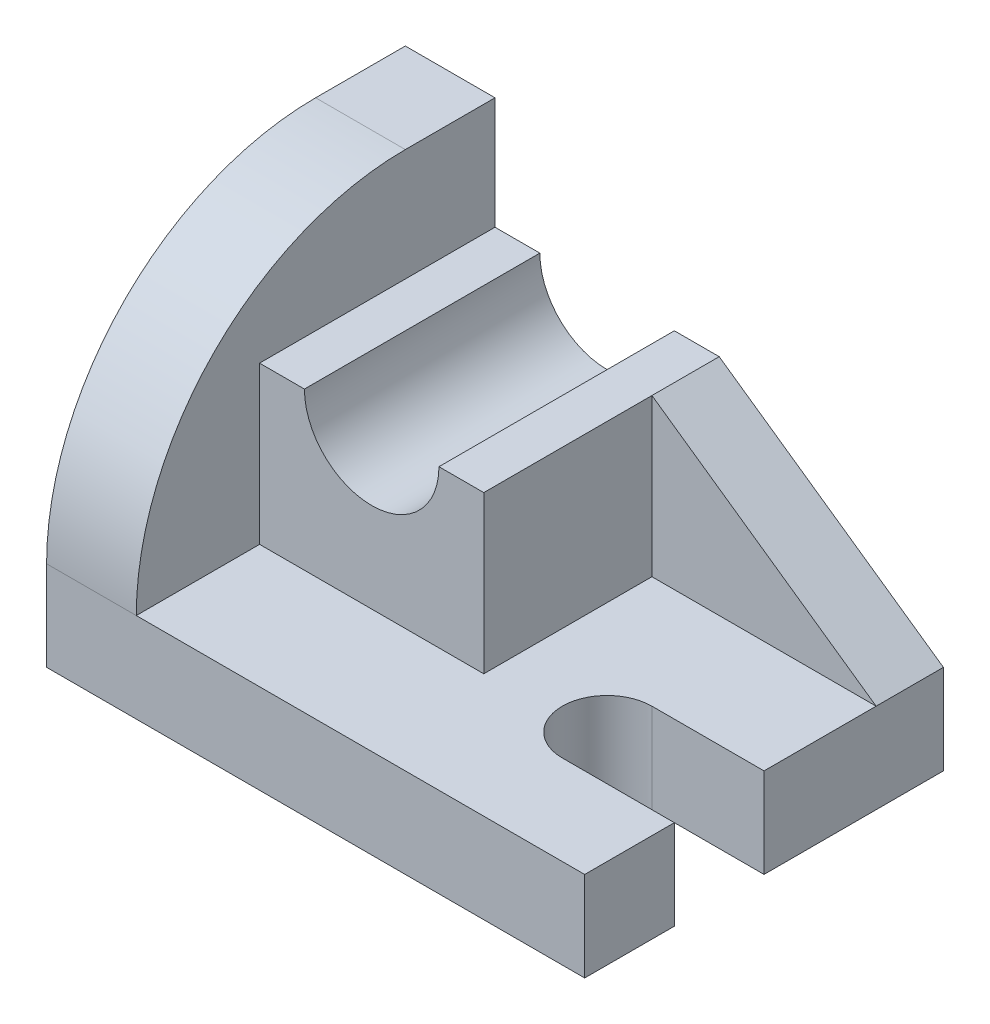
ISO-10303-21;
HEADER;
FILE_DESCRIPTION(('STEP AP214'),'2;1');
FILE_NAME('part.step','',(''),(''),'','','');
FILE_SCHEMA(('AUTOMOTIVE_DESIGN { 1 0 10303 214 1 1 1 1 }'));
ENDSEC;
DATA;
#1=APPLICATION_CONTEXT('core data for automotive mechanical design processes');
#2=APPLICATION_PROTOCOL_DEFINITION('international standard','automotive_design',2000,#1);
#3=PRODUCT_CONTEXT('',#1,'mechanical');
#4=PRODUCT('Part','Part','',(#3));
#5=PRODUCT_RELATED_PRODUCT_CATEGORY('part','',(#4));
#6=PRODUCT_DEFINITION_FORMATION('','',#4);
#7=PRODUCT_DEFINITION_CONTEXT('part definition',#1,'design');
#8=PRODUCT_DEFINITION('design','',#6,#7);
#9=PRODUCT_DEFINITION_SHAPE('','',#8);
#10=(LENGTH_UNIT() NAMED_UNIT(*) SI_UNIT(.MILLI.,.METRE.));
#11=(NAMED_UNIT(*) PLANE_ANGLE_UNIT() SI_UNIT($,.RADIAN.));
#12=(NAMED_UNIT(*) SI_UNIT($,.STERADIAN.) SOLID_ANGLE_UNIT());
#13=UNCERTAINTY_MEASURE_WITH_UNIT(LENGTH_MEASURE(1.E-05),#10,'distance_accuracy_value','');
#14=(GEOMETRIC_REPRESENTATION_CONTEXT(3) GLOBAL_UNCERTAINTY_ASSIGNED_CONTEXT((#13)) GLOBAL_UNIT_ASSIGNED_CONTEXT((#10,
#11,#12)) REPRESENTATION_CONTEXT('',''));
#15=CARTESIAN_POINT('',(0.,0.,0.));
#16=DIRECTION('',(0.,0.,1.));
#17=DIRECTION('',(1.,0.,0.));
#18=AXIS2_PLACEMENT_3D('',#15,#16,#17);
#19=CARTESIAN_POINT('',(56.,44.,-52.));
#20=DIRECTION('',(-1.,0.,0.));
#21=DIRECTION('',(0.,0.,1.));
#22=AXIS2_PLACEMENT_3D('',#19,#20,#21);
#23=PLANE('',#22);
#24=DIRECTION('',(0.,1.,0.));
#25=VECTOR('',#24,1.);
#26=CARTESIAN_POINT('',(56.,44.,-64.));
#27=LINE('',#26,#25);
#28=CARTESIAN_POINT('',(56.,16.,-64.));
#29=VERTEX_POINT('',#28);
#30=CARTESIAN_POINT('',(56.,44.,-64.));
#31=VERTEX_POINT('',#30);
#32=EDGE_CURVE('E101',#29,#31,#27,.T.);
#33=ORIENTED_EDGE('',*,*,#32,.F.);
#34=DIRECTION('',(0.,0.,-1.));
#35=VECTOR('',#34,1.);
#36=CARTESIAN_POINT('',(56.,16.,-52.));
#37=LINE('',#36,#35);
#38=CARTESIAN_POINT('',(56.,16.,-52.));
#39=VERTEX_POINT('',#38);
#40=EDGE_CURVE('E12',#39,#29,#37,.T.);
#41=ORIENTED_EDGE('',*,*,#40,.F.);
#42=DIRECTION('',(0.,1.,0.));
#43=VECTOR('',#42,1.);
#44=CARTESIAN_POINT('',(56.,44.,-52.));
#45=LINE('',#44,#43);
#46=CARTESIAN_POINT('',(56.,44.,-52.));
#47=VERTEX_POINT('',#46);
#48=EDGE_CURVE('E93',#39,#47,#45,.T.);
#49=ORIENTED_EDGE('',*,*,#48,.T.);
#50=DIRECTION('',(0.,0.,-1.));
#51=VECTOR('',#50,1.);
#52=CARTESIAN_POINT('',(56.,44.,-52.));
#53=LINE('',#52,#51);
#54=EDGE_CURVE('E52',#47,#31,#53,.T.);
#55=ORIENTED_EDGE('',*,*,#54,.T.);
#56=EDGE_LOOP('',(#33,#41,#49,#55));
#57=FACE_BOUND('',#56,.T.);
#58=ADVANCED_FACE('F49',(#57),#23,.T.);
#59=CARTESIAN_POINT('',(56.,16.,-52.));
#60=DIRECTION('',(0.,-1.,0.));
#61=DIRECTION('',(0.,0.,-1.));
#62=AXIS2_PLACEMENT_3D('',#59,#60,#61);
#63=PLANE('',#62);
#64=DIRECTION('',(-1.,0.,0.));
#65=VECTOR('',#64,1.);
#66=CARTESIAN_POINT('',(56.,16.,-64.));
#67=LINE('',#66,#65);
#68=CARTESIAN_POINT('',(96.,16.,-64.));
#69=VERTEX_POINT('',#68);
#70=EDGE_CURVE('E95',#69,#29,#67,.T.);
#71=ORIENTED_EDGE('',*,*,#70,.F.);
#72=DIRECTION('',(0.,0.,-1.));
#73=VECTOR('',#72,1.);
#74=CARTESIAN_POINT('',(96.,16.,-52.));
#75=LINE('',#74,#73);
#76=CARTESIAN_POINT('',(96.,16.,-52.));
#77=VERTEX_POINT('',#76);
#78=EDGE_CURVE('E58',#77,#69,#75,.T.);
#79=ORIENTED_EDGE('',*,*,#78,.F.);
#80=DIRECTION('',(-1.,0.,0.));
#81=VECTOR('',#80,1.);
#82=CARTESIAN_POINT('',(56.,16.,-52.));
#83=LINE('',#82,#81);
#84=EDGE_CURVE('E90',#77,#39,#83,.T.);
#85=ORIENTED_EDGE('',*,*,#84,.T.);
#86=ORIENTED_EDGE('',*,*,#40,.T.);
#87=EDGE_LOOP('',(#71,#79,#85,#86));
#88=FACE_BOUND('',#87,.T.);
#89=ADVANCED_FACE('F105',(#88),#63,.T.);
#90=CARTESIAN_POINT('',(56.,44.,-52.));
#91=DIRECTION('',(0.573462344363328,0.81923192051904,0.));
#92=DIRECTION('',(-0.81923192051904,0.573462344363328,0.));
#93=AXIS2_PLACEMENT_3D('',#90,#91,#92);
#94=PLANE('',#93);
#95=DIRECTION('',(0.81923192051904,-0.573462344363328,0.));
#96=VECTOR('',#95,1.);
#97=CARTESIAN_POINT('',(56.,44.,-64.));
#98=LINE('',#97,#96);
#99=EDGE_CURVE('E88',#31,#69,#98,.T.);
#100=ORIENTED_EDGE('',*,*,#99,.F.);
#101=ORIENTED_EDGE('',*,*,#54,.F.);
#102=DIRECTION('',(0.81923192051904,-0.573462344363328,0.));
#103=VECTOR('',#102,1.);
#104=CARTESIAN_POINT('',(56.,44.,-52.));
#105=LINE('',#104,#103);
#106=EDGE_CURVE('E86',#47,#77,#105,.T.);
#107=ORIENTED_EDGE('',*,*,#106,.T.);
#108=ORIENTED_EDGE('',*,*,#78,.T.);
#109=EDGE_LOOP('',(#100,#101,#107,#108));
#110=FACE_BOUND('',#109,.T.);
#111=ADVANCED_FACE('F85',(#110),#94,.T.);
#112=CARTESIAN_POINT('',(0.,0.,-52.));
#113=DIRECTION('',(0.,0.,1.));
#114=DIRECTION('',(1.,0.,0.));
#115=AXIS2_PLACEMENT_3D('',#112,#113,#114);
#116=PLANE('',#115);
#117=ORIENTED_EDGE('',*,*,#48,.F.);
#118=ORIENTED_EDGE('',*,*,#84,.F.);
#119=ORIENTED_EDGE('',*,*,#106,.F.);
#120=EDGE_LOOP('',(#117,#118,#119));
#121=FACE_BOUND('',#120,.T.);
#122=ADVANCED_FACE('F92',(#121),#116,.T.);
#123=CARTESIAN_POINT('',(0.,0.,-64.));
#124=DIRECTION('',(0.,0.,1.));
#125=DIRECTION('',(1.,0.,0.));
#126=AXIS2_PLACEMENT_3D('',#123,#124,#125);
#127=PLANE('',#126);
#128=ORIENTED_EDGE('',*,*,#32,.T.);
#129=ORIENTED_EDGE('',*,*,#99,.T.);
#130=ORIENTED_EDGE('',*,*,#70,.T.);
#131=EDGE_LOOP('',(#128,#129,#130));
#132=FACE_BOUND('',#131,.T.);
#133=ADVANCED_FACE('F104',(#132),#127,.F.);
#134=CLOSED_SHELL('',(#58,#89,#111,#122,#133));
#135=MANIFOLD_SOLID_BREP('B2',#134);
#136=CARTESIAN_POINT('',(0.,44.,0.));
#137=DIRECTION('',(0.,1.,0.));
#138=DIRECTION('',(0.,0.,1.));
#139=AXIS2_PLACEMENT_3D('',#136,#137,#138);
#140=PLANE('',#139);
#141=DIRECTION('',(0.,0.,1.));
#142=VECTOR('',#141,1.);
#143=CARTESIAN_POINT('',(24.,44.,-64.001));
#144=LINE('',#143,#142);
#145=CARTESIAN_POINT('',(24.,44.,-22.));
#146=VERTEX_POINT('',#145);
#147=CARTESIAN_POINT('',(24.,44.,-64.));
#148=VERTEX_POINT('',#147);
#149=EDGE_CURVE('E263',#146,#148,#144,.F.);
#150=ORIENTED_EDGE('',*,*,#149,.T.);
#151=DIRECTION('',(-1.,0.,0.));
#152=VECTOR('',#151,1.);
#153=CARTESIAN_POINT('',(16.,44.,-64.));
#154=LINE('',#153,#152);
#155=CARTESIAN_POINT('',(16.,44.,-64.));
#156=VERTEX_POINT('',#155);
#157=EDGE_CURVE('E272',#148,#156,#154,.T.);
#158=ORIENTED_EDGE('',*,*,#157,.T.);
#159=DIRECTION('',(0.,0.,1.));
#160=VECTOR('',#159,1.);
#161=CARTESIAN_POINT('',(16.,44.,-64.));
#162=LINE('',#161,#160);
#163=CARTESIAN_POINT('',(16.,44.,-22.));
#164=VERTEX_POINT('',#163);
#165=EDGE_CURVE('E293',#156,#164,#162,.T.);
#166=ORIENTED_EDGE('',*,*,#165,.T.);
#167=DIRECTION('',(1.,0.,0.));
#168=VECTOR('',#167,1.);
#169=CARTESIAN_POINT('',(16.,44.,-22.));
#170=LINE('',#169,#168);
#171=EDGE_CURVE('E612',#164,#146,#170,.T.);
#172=ORIENTED_EDGE('',*,*,#171,.T.);
#173=EDGE_LOOP('',(#150,#158,#166,#172));
#174=FACE_BOUND('',#173,.T.);
#175=ADVANCED_FACE('F146',(#174),#140,.T.);
#176=CARTESIAN_POINT('',(0.,16.,0.));
#177=DIRECTION('',(0.,1.,0.));
#178=DIRECTION('',(0.,0.,1.));
#179=AXIS2_PLACEMENT_3D('',#176,#177,#178);
#180=PLANE('',#179);
#181=DIRECTION('',(0.,0.,-1.));
#182=VECTOR('',#181,1.);
#183=CARTESIAN_POINT('',(56.,16.,-64.));
#184=LINE('',#183,#182);
#185=CARTESIAN_POINT('',(56.,16.,-22.));
#186=VERTEX_POINT('',#185);
#187=CARTESIAN_POINT('',(56.,16.,-64.));
#188=VERTEX_POINT('',#187);
#189=EDGE_CURVE('E170',#186,#188,#184,.T.);
#190=ORIENTED_EDGE('',*,*,#189,.F.);
#191=DIRECTION('',(1.,0.,0.));
#192=VECTOR('',#191,1.);
#193=CARTESIAN_POINT('',(16.,16.,-22.));
#194=LINE('',#193,#192);
#195=CARTESIAN_POINT('',(16.,16.,-22.));
#196=VERTEX_POINT('',#195);
#197=EDGE_CURVE('E274',#196,#186,#194,.T.);
#198=ORIENTED_EDGE('',*,*,#197,.F.);
#199=DIRECTION('',(0.,0.,-1.));
#200=VECTOR('',#199,1.);
#201=CARTESIAN_POINT('',(16.,16.,0.));
#202=LINE('',#201,#200);
#203=CARTESIAN_POINT('',(16.,15.9999999999997,0.));
#204=VERTEX_POINT('',#203);
#205=EDGE_CURVE('E326',#204,#196,#202,.T.);
#206=ORIENTED_EDGE('',*,*,#205,.F.);
#207=DIRECTION('',(1.,0.,0.));
#208=VECTOR('',#207,1.);
#209=CARTESIAN_POINT('',(0.,16.,0.));
#210=LINE('',#209,#208);
#211=CARTESIAN_POINT('',(96.,16.,0.));
#212=VERTEX_POINT('',#211);
#213=EDGE_CURVE('E373',#204,#212,#210,.T.);
#214=ORIENTED_EDGE('',*,*,#213,.T.);
#215=DIRECTION('',(0.,0.,-1.));
#216=VECTOR('',#215,1.);
#217=CARTESIAN_POINT('',(96.,16.,0.));
#218=LINE('',#217,#216);
#219=CARTESIAN_POINT('',(96.,16.,-16.));
#220=VERTEX_POINT('',#219);
#221=EDGE_CURVE('E374',#212,#220,#218,.T.);
#222=ORIENTED_EDGE('',*,*,#221,.T.);
#223=DIRECTION('',(1.,0.,0.));
#224=VECTOR('',#223,1.);
#225=CARTESIAN_POINT('',(96.,16.,-16.));
#226=LINE('',#225,#224);
#227=CARTESIAN_POINT('',(76.,16.,-16.));
#228=VERTEX_POINT('',#227);
#229=EDGE_CURVE('E338',#228,#220,#226,.T.);
#230=ORIENTED_EDGE('',*,*,#229,.F.);
#231=CARTESIAN_POINT('',(76.,16.,-24.));
#232=DIRECTION('',(0.,1.,0.));
#233=DIRECTION('',(0.,0.,1.));
#234=AXIS2_PLACEMENT_3D('',#231,#232,#233);
#235=CIRCLE('',#234,8.);
#236=CARTESIAN_POINT('',(76.,16.,-32.));
#237=VERTEX_POINT('',#236);
#238=EDGE_CURVE('E350',#237,#228,#235,.T.);
#239=ORIENTED_EDGE('',*,*,#238,.F.);
#240=DIRECTION('',(-1.,0.,0.));
#241=VECTOR('',#240,1.);
#242=CARTESIAN_POINT('',(96.,16.,-32.));
#243=LINE('',#242,#241);
#244=CARTESIAN_POINT('',(96.,16.,-32.));
#245=VERTEX_POINT('',#244);
#246=EDGE_CURVE('E332',#245,#237,#243,.T.);
#247=ORIENTED_EDGE('',*,*,#246,.F.);
#248=CARTESIAN_POINT('',(96.,16.,-64.));
#249=VERTEX_POINT('',#248);
#250=EDGE_CURVE('E372',#245,#249,#218,.T.);
#251=ORIENTED_EDGE('',*,*,#250,.T.);
#252=DIRECTION('',(1.,0.,0.));
#253=VECTOR('',#252,1.);
#254=CARTESIAN_POINT('',(0.,16.,-64.));
#255=LINE('',#254,#253);
#256=EDGE_CURVE('E378',#188,#249,#255,.T.);
#257=ORIENTED_EDGE('',*,*,#256,.F.);
#258=EDGE_LOOP('',(#190,#198,#206,#214,#222,#230,#239,#247,#251,#257));
#259=FACE_BOUND('',#258,.T.);
#260=ADVANCED_FACE('F416',(#259),#180,.T.);
#261=CARTESIAN_POINT('',(16.,16.,-48.));
#262=DIRECTION('',(1.,0.,0.));
#263=DIRECTION('',(0.,0.,-1.));
#264=AXIS2_PLACEMENT_3D('',#261,#262,#263);
#265=PLANE('',#264);
#266=ORIENTED_EDGE('',*,*,#205,.T.);
#267=DIRECTION('',(0.,-1.,0.));
#268=VECTOR('',#267,1.);
#269=CARTESIAN_POINT('',(16.,44.,-22.));
#270=LINE('',#269,#268);
#271=EDGE_CURVE('E298',#164,#196,#270,.T.);
#272=ORIENTED_EDGE('',*,*,#271,.F.);
#273=ORIENTED_EDGE('',*,*,#165,.F.);
#274=DIRECTION('',(0.,-1.,0.));
#275=VECTOR('',#274,1.);
#276=CARTESIAN_POINT('',(16.,0.,-64.));
#277=LINE('',#276,#275);
#278=CARTESIAN_POINT('',(16.,64.,-64.));
#279=VERTEX_POINT('',#278);
#280=EDGE_CURVE('E312',#279,#156,#277,.T.);
#281=ORIENTED_EDGE('',*,*,#280,.F.);
#282=DIRECTION('',(0.,0.,-1.));
#283=VECTOR('',#282,1.);
#284=CARTESIAN_POINT('',(16.,64.,-48.0000000000003));
#285=LINE('',#284,#283);
#286=CARTESIAN_POINT('',(16.,64.,-48.0000000000003));
#287=VERTEX_POINT('',#286);
#288=EDGE_CURVE('E307',#287,#279,#285,.T.);
#289=ORIENTED_EDGE('',*,*,#288,.F.);
#290=CARTESIAN_POINT('',(16.,16.,-48.));
#291=DIRECTION('',(-1.,0.,0.));
#292=DIRECTION('',(0.,0.,-1.));
#293=AXIS2_PLACEMENT_3D('',#290,#291,#292);
#294=CIRCLE('',#293,48.);
#295=EDGE_CURVE('E303',#204,#287,#294,.T.);
#296=ORIENTED_EDGE('',*,*,#295,.F.);
#297=EDGE_LOOP('',(#266,#272,#273,#281,#289,#296));
#298=FACE_BOUND('',#297,.T.);
#299=ADVANCED_FACE('F449',(#298),#265,.T.);
#300=CARTESIAN_POINT('',(96.,16.,0.));
#301=DIRECTION('',(-1.,0.,0.));
#302=DIRECTION('',(0.,0.,1.));
#303=AXIS2_PLACEMENT_3D('',#300,#301,#302);
#304=PLANE('',#303);
#305=DIRECTION('',(0.,0.,-1.));
#306=VECTOR('',#305,1.);
#307=CARTESIAN_POINT('',(96.,0.,0.));
#308=LINE('',#307,#306);
#309=CARTESIAN_POINT('',(96.,0.,0.));
#310=VERTEX_POINT('',#309);
#311=CARTESIAN_POINT('',(96.,0.,-16.));
#312=VERTEX_POINT('',#311);
#313=EDGE_CURVE('E385',#310,#312,#308,.T.);
#314=ORIENTED_EDGE('',*,*,#313,.T.);
#315=DIRECTION('',(0.,1.,0.));
#316=VECTOR('',#315,1.);
#317=CARTESIAN_POINT('',(96.,0.,-16.));
#318=LINE('',#317,#316);
#319=EDGE_CURVE('E356',#312,#220,#318,.T.);
#320=ORIENTED_EDGE('',*,*,#319,.T.);
#321=ORIENTED_EDGE('',*,*,#221,.F.);
#322=DIRECTION('',(0.,-1.,0.));
#323=VECTOR('',#322,1.);
#324=CARTESIAN_POINT('',(96.,16.,0.));
#325=LINE('',#324,#323);
#326=EDGE_CURVE('E47',#212,#310,#325,.T.);
#327=ORIENTED_EDGE('',*,*,#326,.T.);
#328=EDGE_LOOP('',(#314,#320,#321,#327));
#329=FACE_BOUND('',#328,.T.);
#330=ADVANCED_FACE('F431',(#329),#304,.F.);
#331=CARTESIAN_POINT('',(0.,16.,0.));
#332=DIRECTION('',(0.,0.,-1.));
#333=DIRECTION('',(-1.,0.,0.));
#334=AXIS2_PLACEMENT_3D('',#331,#332,#333);
#335=PLANE('',#334);
#336=ORIENTED_EDGE('',*,*,#213,.F.);
#337=CARTESIAN_POINT('',(0.,15.9999999999997,0.));
#338=VERTEX_POINT('',#337);
#339=EDGE_CURVE('E369',#338,#204,#210,.T.);
#340=ORIENTED_EDGE('',*,*,#339,.F.);
#341=DIRECTION('',(0.,-1.,0.));
#342=VECTOR('',#341,1.);
#343=CARTESIAN_POINT('',(0.,16.,0.));
#344=LINE('',#343,#342);
#345=CARTESIAN_POINT('',(0.,0.,0.));
#346=VERTEX_POINT('',#345);
#347=EDGE_CURVE('E381',#338,#346,#344,.T.);
#348=ORIENTED_EDGE('',*,*,#347,.T.);
#349=DIRECTION('',(1.,0.,0.));
#350=VECTOR('',#349,1.);
#351=CARTESIAN_POINT('',(0.,0.,0.));
#352=LINE('',#351,#350);
#353=EDGE_CURVE('E360',#346,#310,#352,.T.);
#354=ORIENTED_EDGE('',*,*,#353,.T.);
#355=ORIENTED_EDGE('',*,*,#326,.F.);
#356=EDGE_LOOP('',(#336,#340,#348,#354,#355));
#357=FACE_BOUND('',#356,.T.);
#358=ADVANCED_FACE('F148',(#357),#335,.F.);
#359=ORIENTED_EDGE('',*,*,#250,.F.);
#360=DIRECTION('',(0.,1.,0.));
#361=VECTOR('',#360,1.);
#362=CARTESIAN_POINT('',(96.,0.,-32.));
#363=LINE('',#362,#361);
#364=CARTESIAN_POINT('',(96.,0.,-32.));
#365=VERTEX_POINT('',#364);
#366=EDGE_CURVE('E346',#365,#245,#363,.T.);
#367=ORIENTED_EDGE('',*,*,#366,.F.);
#368=CARTESIAN_POINT('',(96.,0.,-64.));
#369=VERTEX_POINT('',#368);
#370=EDGE_CURVE('E384',#365,#369,#308,.T.);
#371=ORIENTED_EDGE('',*,*,#370,.T.);
#372=DIRECTION('',(0.,-1.,0.));
#373=VECTOR('',#372,1.);
#374=CARTESIAN_POINT('',(96.,16.,-64.));
#375=LINE('',#374,#373);
#376=EDGE_CURVE('E155',#249,#369,#375,.T.);
#377=ORIENTED_EDGE('',*,*,#376,.F.);
#378=EDGE_LOOP('',(#359,#367,#371,#377));
#379=FACE_BOUND('',#378,.T.);
#380=ADVANCED_FACE('F408',(#379),#304,.F.);
#381=CARTESIAN_POINT('',(0.,16.,-64.));
#382=DIRECTION('',(0.,0.,-1.));
#383=DIRECTION('',(-1.,0.,0.));
#384=AXIS2_PLACEMENT_3D('',#381,#382,#383);
#385=PLANE('',#384);
#386=CARTESIAN_POINT('',(36.,44.,-64.));
#387=DIRECTION('',(0.,0.,-1.));
#388=DIRECTION('',(-1.,0.,0.));
#389=AXIS2_PLACEMENT_3D('',#386,#387,#388);
#390=CIRCLE('',#389,12.);
#391=CARTESIAN_POINT('',(48.,44.,-64.));
#392=VERTEX_POINT('',#391);
#393=EDGE_CURVE('E257',#148,#392,#390,.F.);
#394=ORIENTED_EDGE('',*,*,#393,.T.);
#395=CARTESIAN_POINT('',(56.,44.,-64.));
#396=VERTEX_POINT('',#395);
#397=EDGE_CURVE('E270',#396,#392,#154,.T.);
#398=ORIENTED_EDGE('',*,*,#397,.F.);
#399=DIRECTION('',(0.,-1.,0.));
#400=VECTOR('',#399,1.);
#401=CARTESIAN_POINT('',(56.,44.,-64.));
#402=LINE('',#401,#400);
#403=EDGE_CURVE('E281',#396,#188,#402,.T.);
#404=ORIENTED_EDGE('',*,*,#403,.T.);
#405=ORIENTED_EDGE('',*,*,#256,.T.);
#406=ORIENTED_EDGE('',*,*,#376,.T.);
#407=DIRECTION('',(1.,0.,0.));
#408=VECTOR('',#407,1.);
#409=CARTESIAN_POINT('',(0.,0.,-64.));
#410=LINE('',#409,#408);
#411=CARTESIAN_POINT('',(0.,0.,-64.));
#412=VERTEX_POINT('',#411);
#413=EDGE_CURVE('E389',#412,#369,#410,.T.);
#414=ORIENTED_EDGE('',*,*,#413,.F.);
#415=DIRECTION('',(0.,-1.,0.));
#416=VECTOR('',#415,1.);
#417=CARTESIAN_POINT('',(0.,16.,-64.));
#418=LINE('',#417,#416);
#419=CARTESIAN_POINT('',(0.,64.,-64.));
#420=VERTEX_POINT('',#419);
#421=EDGE_CURVE('E398',#420,#412,#418,.T.);
#422=ORIENTED_EDGE('',*,*,#421,.F.);
#423=DIRECTION('',(-1.,0.,0.));
#424=VECTOR('',#423,1.);
#425=CARTESIAN_POINT('',(16.,64.,-64.));
#426=LINE('',#425,#424);
#427=EDGE_CURVE('E322',#279,#420,#426,.T.);
#428=ORIENTED_EDGE('',*,*,#427,.F.);
#429=ORIENTED_EDGE('',*,*,#280,.T.);
#430=ORIENTED_EDGE('',*,*,#157,.F.);
#431=EDGE_LOOP('',(#394,#398,#404,#405,#406,#414,#422,#428,#429,#430));
#432=FACE_BOUND('',#431,.T.);
#433=ADVANCED_FACE('F268',(#432),#385,.T.);
#434=CARTESIAN_POINT('',(0.,16.,0.));
#435=DIRECTION('',(-1.,0.,0.));
#436=DIRECTION('',(0.,0.,1.));
#437=AXIS2_PLACEMENT_3D('',#434,#435,#436);
#438=PLANE('',#437);
#439=DIRECTION('',(0.,0.,-1.));
#440=VECTOR('',#439,1.);
#441=CARTESIAN_POINT('',(0.,0.,0.));
#442=LINE('',#441,#440);
#443=EDGE_CURVE('E392',#346,#412,#442,.T.);
#444=ORIENTED_EDGE('',*,*,#443,.F.);
#445=ORIENTED_EDGE('',*,*,#347,.F.);
#446=CARTESIAN_POINT('',(0.,16.,-48.));
#447=DIRECTION('',(-1.,0.,0.));
#448=DIRECTION('',(0.,0.,-1.));
#449=AXIS2_PLACEMENT_3D('',#446,#447,#448);
#450=CIRCLE('',#449,48.);
#451=CARTESIAN_POINT('',(0.,64.,-48.0000000000003));
#452=VERTEX_POINT('',#451);
#453=EDGE_CURVE('E302',#338,#452,#450,.T.);
#454=ORIENTED_EDGE('',*,*,#453,.T.);
#455=DIRECTION('',(0.,0.,-1.));
#456=VECTOR('',#455,1.);
#457=CARTESIAN_POINT('',(0.,64.,-48.0000000000003));
#458=LINE('',#457,#456);
#459=EDGE_CURVE('E308',#452,#420,#458,.T.);
#460=ORIENTED_EDGE('',*,*,#459,.T.);
#461=ORIENTED_EDGE('',*,*,#421,.T.);
#462=EDGE_LOOP('',(#444,#445,#454,#460,#461));
#463=FACE_BOUND('',#462,.T.);
#464=ADVANCED_FACE('F441',(#463),#438,.T.);
#465=CARTESIAN_POINT('',(0.,0.,0.));
#466=DIRECTION('',(0.,1.,0.));
#467=DIRECTION('',(0.,0.,1.));
#468=AXIS2_PLACEMENT_3D('',#465,#466,#467);
#469=PLANE('',#468);
#470=ORIENTED_EDGE('',*,*,#313,.F.);
#471=ORIENTED_EDGE('',*,*,#353,.F.);
#472=ORIENTED_EDGE('',*,*,#443,.T.);
#473=ORIENTED_EDGE('',*,*,#413,.T.);
#474=ORIENTED_EDGE('',*,*,#370,.F.);
#475=DIRECTION('',(-1.,0.,0.));
#476=VECTOR('',#475,1.);
#477=CARTESIAN_POINT('',(96.,0.,-32.));
#478=LINE('',#477,#476);
#479=CARTESIAN_POINT('',(76.,0.,-32.));
#480=VERTEX_POINT('',#479);
#481=EDGE_CURVE('E333',#365,#480,#478,.T.);
#482=ORIENTED_EDGE('',*,*,#481,.T.);
#483=CARTESIAN_POINT('',(76.,0.,-24.));
#484=DIRECTION('',(0.,1.,0.));
#485=DIRECTION('',(0.,0.,1.));
#486=AXIS2_PLACEMENT_3D('',#483,#484,#485);
#487=CIRCLE('',#486,8.);
#488=CARTESIAN_POINT('',(76.,0.,-16.));
#489=VERTEX_POINT('',#488);
#490=EDGE_CURVE('E337',#480,#489,#487,.T.);
#491=ORIENTED_EDGE('',*,*,#490,.T.);
#492=DIRECTION('',(1.,0.,0.));
#493=VECTOR('',#492,1.);
#494=CARTESIAN_POINT('',(96.,0.,-16.));
#495=LINE('',#494,#493);
#496=EDGE_CURVE('E342',#489,#312,#495,.T.);
#497=ORIENTED_EDGE('',*,*,#496,.T.);
#498=EDGE_LOOP('',(#470,#471,#472,#473,#474,#482,#491,#497));
#499=FACE_BOUND('',#498,.T.);
#500=ADVANCED_FACE('F423',(#499),#469,.F.);
#501=CARTESIAN_POINT('',(96.,0.,-16.));
#502=DIRECTION('',(0.,0.,1.));
#503=DIRECTION('',(1.,0.,0.));
#504=AXIS2_PLACEMENT_3D('',#501,#502,#503);
#505=PLANE('',#504);
#506=ORIENTED_EDGE('',*,*,#229,.T.);
#507=ORIENTED_EDGE('',*,*,#319,.F.);
#508=ORIENTED_EDGE('',*,*,#496,.F.);
#509=DIRECTION('',(0.,1.,0.));
#510=VECTOR('',#509,1.);
#511=CARTESIAN_POINT('',(76.,0.,-16.));
#512=LINE('',#511,#510);
#513=EDGE_CURVE('E361',#489,#228,#512,.T.);
#514=ORIENTED_EDGE('',*,*,#513,.T.);
#515=EDGE_LOOP('',(#506,#507,#508,#514));
#516=FACE_BOUND('',#515,.T.);
#517=ADVANCED_FACE('F428',(#516),#505,.F.);
#518=CARTESIAN_POINT('',(76.,0.,-24.));
#519=DIRECTION('',(0.,1.,0.));
#520=DIRECTION('',(0.,0.,1.));
#521=AXIS2_PLACEMENT_3D('',#518,#519,#520);
#522=CYLINDRICAL_SURFACE('',#521,8.);
#523=ORIENTED_EDGE('',*,*,#238,.T.);
#524=ORIENTED_EDGE('',*,*,#513,.F.);
#525=ORIENTED_EDGE('',*,*,#490,.F.);
#526=DIRECTION('',(0.,1.,0.));
#527=VECTOR('',#526,1.);
#528=CARTESIAN_POINT('',(76.,0.,-32.));
#529=LINE('',#528,#527);
#530=EDGE_CURVE('E364',#480,#237,#529,.T.);
#531=ORIENTED_EDGE('',*,*,#530,.T.);
#532=EDGE_LOOP('',(#523,#524,#525,#531));
#533=FACE_BOUND('',#532,.T.);
#534=ADVANCED_FACE('F426',(#533),#522,.F.);
#535=CARTESIAN_POINT('',(96.,0.,-32.));
#536=DIRECTION('',(0.,0.,-1.));
#537=DIRECTION('',(-1.,0.,0.));
#538=AXIS2_PLACEMENT_3D('',#535,#536,#537);
#539=PLANE('',#538);
#540=ORIENTED_EDGE('',*,*,#246,.T.);
#541=ORIENTED_EDGE('',*,*,#530,.F.);
#542=ORIENTED_EDGE('',*,*,#481,.F.);
#543=ORIENTED_EDGE('',*,*,#366,.T.);
#544=EDGE_LOOP('',(#540,#541,#542,#543));
#545=FACE_BOUND('',#544,.T.);
#546=ADVANCED_FACE('F421',(#545),#539,.F.);
#547=CARTESIAN_POINT('',(16.,64.,-48.0000000000003));
#548=DIRECTION('',(0.,1.,0.));
#549=DIRECTION('',(0.,0.,1.));
#550=AXIS2_PLACEMENT_3D('',#547,#548,#549);
#551=PLANE('',#550);
#552=ORIENTED_EDGE('',*,*,#459,.F.);
#553=DIRECTION('',(-1.,0.,0.));
#554=VECTOR('',#553,1.);
#555=CARTESIAN_POINT('',(16.,64.,-48.0000000000003));
#556=LINE('',#555,#554);
#557=EDGE_CURVE('E315',#287,#452,#556,.T.);
#558=ORIENTED_EDGE('',*,*,#557,.F.);
#559=ORIENTED_EDGE('',*,*,#288,.T.);
#560=ORIENTED_EDGE('',*,*,#427,.T.);
#561=EDGE_LOOP('',(#552,#558,#559,#560));
#562=FACE_BOUND('',#561,.T.);
#563=ADVANCED_FACE('F445',(#562),#551,.T.);
#564=CARTESIAN_POINT('',(16.,16.,-48.));
#565=DIRECTION('',(-1.,0.,0.));
#566=DIRECTION('',(0.,0.,1.));
#567=AXIS2_PLACEMENT_3D('',#564,#565,#566);
#568=CYLINDRICAL_SURFACE('',#567,48.);
#569=ORIENTED_EDGE('',*,*,#453,.F.);
#570=ORIENTED_EDGE('',*,*,#339,.T.);
#571=ORIENTED_EDGE('',*,*,#295,.T.);
#572=ORIENTED_EDGE('',*,*,#557,.T.);
#573=EDGE_LOOP('',(#569,#570,#571,#572));
#574=FACE_BOUND('',#573,.T.);
#575=ADVANCED_FACE('F452',(#574),#568,.T.);
#576=CARTESIAN_POINT('',(16.,44.,-22.));
#577=DIRECTION('',(0.,0.,-1.));
#578=DIRECTION('',(-1.,0.,0.));
#579=AXIS2_PLACEMENT_3D('',#576,#577,#578);
#580=PLANE('',#579);
#581=CARTESIAN_POINT('',(48.,44.,-22.));
#582=VERTEX_POINT('',#581);
#583=CARTESIAN_POINT('',(56.,44.,-22.));
#584=VERTEX_POINT('',#583);
#585=EDGE_CURVE('E608',#582,#584,#170,.T.);
#586=ORIENTED_EDGE('',*,*,#585,.F.);
#587=CARTESIAN_POINT('',(36.,44.,-22.));
#588=DIRECTION('',(0.,0.,1.));
#589=DIRECTION('',(1.,0.,0.));
#590=AXIS2_PLACEMENT_3D('',#587,#588,#589);
#591=CIRCLE('',#590,12.);
#592=EDGE_CURVE('E162',#146,#582,#591,.T.);
#593=ORIENTED_EDGE('',*,*,#592,.F.);
#594=ORIENTED_EDGE('',*,*,#171,.F.);
#595=ORIENTED_EDGE('',*,*,#271,.T.);
#596=ORIENTED_EDGE('',*,*,#197,.T.);
#597=DIRECTION('',(0.,-1.,0.));
#598=VECTOR('',#597,1.);
#599=CARTESIAN_POINT('',(56.,44.,-22.));
#600=LINE('',#599,#598);
#601=EDGE_CURVE('E285',#584,#186,#600,.T.);
#602=ORIENTED_EDGE('',*,*,#601,.F.);
#603=EDGE_LOOP('',(#586,#593,#594,#595,#596,#602));
#604=FACE_BOUND('',#603,.T.);
#605=ADVANCED_FACE('F454',(#604),#580,.F.);
#606=CARTESIAN_POINT('',(56.,44.,-64.));
#607=DIRECTION('',(-1.,0.,0.));
#608=DIRECTION('',(0.,0.,1.));
#609=AXIS2_PLACEMENT_3D('',#606,#607,#608);
#610=PLANE('',#609);
#611=ORIENTED_EDGE('',*,*,#189,.T.);
#612=ORIENTED_EDGE('',*,*,#403,.F.);
#613=DIRECTION('',(0.,0.,-1.));
#614=VECTOR('',#613,1.);
#615=CARTESIAN_POINT('',(56.,44.,-64.));
#616=LINE('',#615,#614);
#617=EDGE_CURVE('E278',#584,#396,#616,.T.);
#618=ORIENTED_EDGE('',*,*,#617,.F.);
#619=ORIENTED_EDGE('',*,*,#601,.T.);
#620=EDGE_LOOP('',(#611,#612,#618,#619));
#621=FACE_BOUND('',#620,.T.);
#622=ADVANCED_FACE('F460',(#621),#610,.F.);
#623=DIRECTION('',(0.,0.,1.));
#624=VECTOR('',#623,1.);
#625=CARTESIAN_POINT('',(48.,44.,-64.001));
#626=LINE('',#625,#624);
#627=EDGE_CURVE('E254',#392,#582,#626,.T.);
#628=ORIENTED_EDGE('',*,*,#627,.T.);
#629=ORIENTED_EDGE('',*,*,#585,.T.);
#630=ORIENTED_EDGE('',*,*,#617,.T.);
#631=ORIENTED_EDGE('',*,*,#397,.T.);
#632=EDGE_LOOP('',(#628,#629,#630,#631));
#633=FACE_BOUND('',#632,.T.);
#634=ADVANCED_FACE('F276',(#633),#140,.T.);
#635=CARTESIAN_POINT('',(36.,44.,-64.001));
#636=DIRECTION('',(0.,0.,1.));
#637=DIRECTION('',(1.,0.,0.));
#638=AXIS2_PLACEMENT_3D('',#635,#636,#637);
#639=CYLINDRICAL_SURFACE('',#638,12.);
#640=ORIENTED_EDGE('',*,*,#592,.T.);
#641=ORIENTED_EDGE('',*,*,#627,.F.);
#642=ORIENTED_EDGE('',*,*,#393,.F.);
#643=ORIENTED_EDGE('',*,*,#149,.F.);
#644=EDGE_LOOP('',(#640,#641,#642,#643));
#645=FACE_BOUND('',#644,.T.);
#646=ADVANCED_FACE('F256',(#645),#639,.F.);
#647=CLOSED_SHELL('',(#175,#260,#299,#330,#358,#380,#433,#464,#500,#517,#534,#546,#563,#575,
#605,#622,#634,#646));
#648=MANIFOLD_SOLID_BREP('B6',#647);
#649=ADVANCED_BREP_SHAPE_REPRESENTATION('',(#18,#135,#648),#14);
#650=SHAPE_DEFINITION_REPRESENTATION(#9,#649);
ENDSEC;
END-ISO-10303-21;
